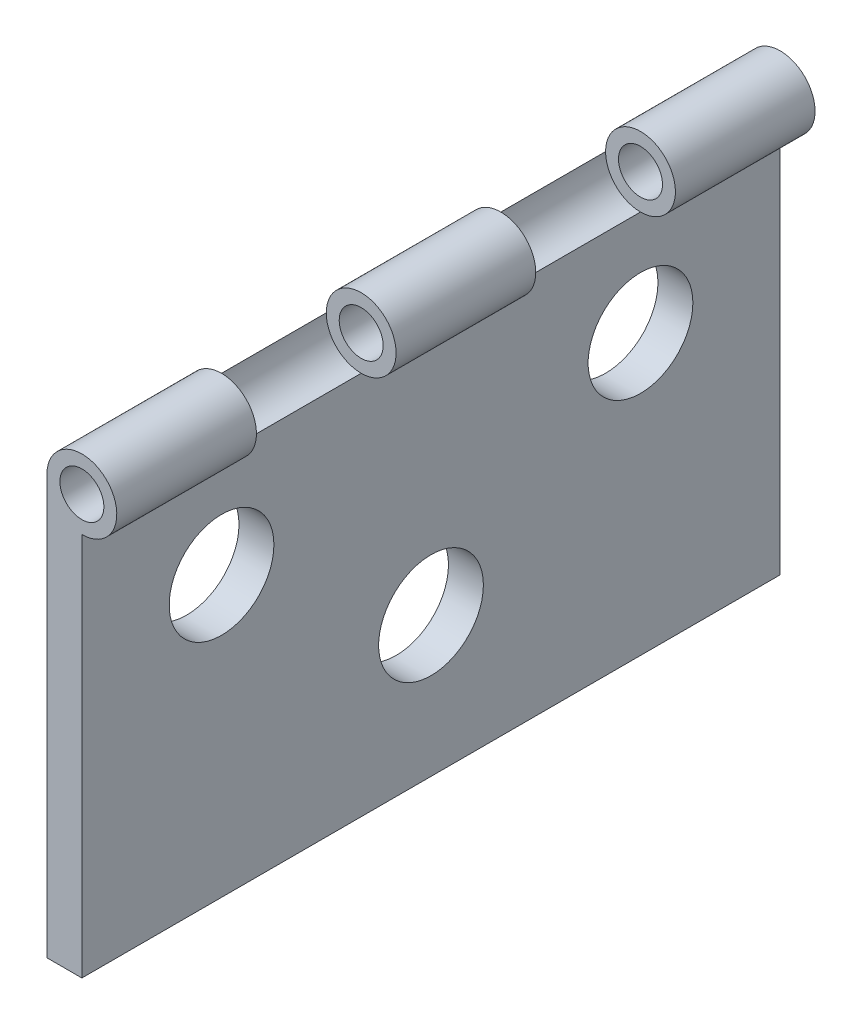
ISO-10303-21;
HEADER;
FILE_DESCRIPTION(('STEP AP214'),'2;1');
FILE_NAME('part.step','',(''),(''),'','','');
FILE_SCHEMA(('AUTOMOTIVE_DESIGN { 1 0 10303 214 1 1 1 1 }'));
ENDSEC;
DATA;
#1=APPLICATION_CONTEXT('core data for automotive mechanical design processes');
#2=APPLICATION_PROTOCOL_DEFINITION('international standard','automotive_design',2000,#1);
#3=PRODUCT_CONTEXT('',#1,'mechanical');
#4=PRODUCT('Part','Part','',(#3));
#5=PRODUCT_RELATED_PRODUCT_CATEGORY('part','',(#4));
#6=PRODUCT_DEFINITION_FORMATION('','',#4);
#7=PRODUCT_DEFINITION_CONTEXT('part definition',#1,'design');
#8=PRODUCT_DEFINITION('design','',#6,#7);
#9=PRODUCT_DEFINITION_SHAPE('','',#8);
#10=(LENGTH_UNIT() NAMED_UNIT(*) SI_UNIT(.MILLI.,.METRE.));
#11=(NAMED_UNIT(*) PLANE_ANGLE_UNIT() SI_UNIT($,.RADIAN.));
#12=(NAMED_UNIT(*) SI_UNIT($,.STERADIAN.) SOLID_ANGLE_UNIT());
#13=UNCERTAINTY_MEASURE_WITH_UNIT(LENGTH_MEASURE(1.E-05),#10,'distance_accuracy_value','');
#14=(GEOMETRIC_REPRESENTATION_CONTEXT(3) GLOBAL_UNCERTAINTY_ASSIGNED_CONTEXT((#13)) GLOBAL_UNIT_ASSIGNED_CONTEXT((#10,
#11,#12)) REPRESENTATION_CONTEXT('',''));
#15=CARTESIAN_POINT('',(0.,0.,0.));
#16=DIRECTION('',(0.,0.,1.));
#17=DIRECTION('',(1.,0.,0.));
#18=AXIS2_PLACEMENT_3D('',#15,#16,#17);
#19=CARTESIAN_POINT('',(1.25000000001163,15.0000000000015,0.));
#20=DIRECTION('',(0.,0.,-0.999999999999977));
#21=DIRECTION('',(0.,1.00000000000009,0.));
#22=AXIS2_PLACEMENT_3D('',#19,#20,#21);
#23=CYLINDRICAL_SURFACE('',#22,0.7875);
#24=CARTESIAN_POINT('',(1.25000000001163,15.0000000000016,0.));
#25=DIRECTION('',(0.,0.,-0.999999999999977));
#26=DIRECTION('',(0.,1.00000000000009,0.));
#27=AXIS2_PLACEMENT_3D('',#24,#25,#26);
#28=CIRCLE('',#27,0.7875);
#29=CARTESIAN_POINT('',(1.25000000001163,15.7875000000016,0.));
#30=VERTEX_POINT('',#29);
#31=EDGE_CURVE('E127',#30,#30,#28,.T.);
#32=ORIENTED_EDGE('',*,*,#31,.F.);
#33=EDGE_LOOP('',(#32));
#34=FACE_BOUND('',#33,.T.);
#35=CARTESIAN_POINT('',(1.25000000001163,15.0000000000018,-4.99999999999998));
#36=DIRECTION('',(0.,0.,-0.999999999999977));
#37=DIRECTION('',(0.,1.00000000000009,0.));
#38=AXIS2_PLACEMENT_3D('',#35,#36,#37);
#39=CIRCLE('',#38,0.7875);
#40=CARTESIAN_POINT('',(1.25000000001163,15.7875000000019,-4.99999999999998));
#41=VERTEX_POINT('',#40);
#42=EDGE_CURVE('E11',#41,#41,#39,.T.);
#43=ORIENTED_EDGE('',*,*,#42,.T.);
#44=EDGE_LOOP('',(#43));
#45=FACE_BOUND('',#44,.T.);
#46=ADVANCED_FACE('F32',(#34,#45),#23,.F.);
#47=CARTESIAN_POINT('',(1.25000000001163,15.0000000000007,-9.99999999999998));
#48=DIRECTION('',(0.,0.,-0.999999999999977));
#49=DIRECTION('',(0.,1.00000000000009,0.));
#50=AXIS2_PLACEMENT_3D('',#47,#48,#49);
#51=CIRCLE('',#50,0.7875);
#52=CARTESIAN_POINT('',(1.25000000001163,15.7875000000008,-9.99999999999998));
#53=VERTEX_POINT('',#52);
#54=EDGE_CURVE('E131',#53,#53,#51,.T.);
#55=ORIENTED_EDGE('',*,*,#54,.F.);
#56=EDGE_LOOP('',(#55));
#57=FACE_BOUND('',#56,.T.);
#58=CARTESIAN_POINT('',(1.25000000001163,15.000000000002,-15.));
#59=DIRECTION('',(0.,0.,-0.999999999999977));
#60=DIRECTION('',(0.,1.00000000000009,0.));
#61=AXIS2_PLACEMENT_3D('',#58,#59,#60);
#62=CIRCLE('',#61,0.7875);
#63=CARTESIAN_POINT('',(1.25000000001163,15.7875000000021,-15.));
#64=VERTEX_POINT('',#63);
#65=EDGE_CURVE('E228',#64,#64,#62,.T.);
#66=ORIENTED_EDGE('',*,*,#65,.T.);
#67=EDGE_LOOP('',(#66));
#68=FACE_BOUND('',#67,.T.);
#69=ADVANCED_FACE('F202',(#57,#68),#23,.F.);
#70=CARTESIAN_POINT('',(1.24999999999997,0.,0.));
#71=DIRECTION('',(-1.00000000000005,0.,0.));
#72=DIRECTION('',(0.,0.,0.999999999999977));
#73=AXIS2_PLACEMENT_3D('',#70,#71,#72);
#74=PLANE('',#73);
#75=CARTESIAN_POINT('',(1.25000000000008,9.99999999999854,-4.99999999999998));
#76=DIRECTION('',(1.00000000000005,0.,0.));
#77=DIRECTION('',(0.,0.,-0.999999999999977));
#78=AXIS2_PLACEMENT_3D('',#75,#76,#77);
#79=CIRCLE('',#78,1.875);
#80=CARTESIAN_POINT('',(1.25000000000008,9.99999999999853,-6.87499999999993));
#81=VERTEX_POINT('',#80);
#82=EDGE_CURVE('E153',#81,#81,#79,.T.);
#83=ORIENTED_EDGE('',*,*,#82,.F.);
#84=EDGE_LOOP('',(#83));
#85=FACE_BOUND('',#84,.T.);
#86=CARTESIAN_POINT('',(1.25000000000008,9.99999999999854,-19.9999999999992));
#87=DIRECTION('',(1.00000000000005,0.,0.));
#88=DIRECTION('',(0.,0.,-0.999999999999977));
#89=AXIS2_PLACEMENT_3D('',#86,#87,#88);
#90=CIRCLE('',#89,1.875);
#91=CARTESIAN_POINT('',(1.25000000000008,9.99999999999853,-21.8749999999992));
#92=VERTEX_POINT('',#91);
#93=EDGE_CURVE('E165',#92,#92,#90,.T.);
#94=ORIENTED_EDGE('',*,*,#93,.F.);
#95=EDGE_LOOP('',(#94));
#96=FACE_BOUND('',#95,.T.);
#97=CARTESIAN_POINT('',(1.25000000001163,4.99999999999862,-12.4999999999971));
#98=DIRECTION('',(1.00000000000005,0.,0.));
#99=DIRECTION('',(0.,0.,-0.999999999999977));
#100=AXIS2_PLACEMENT_3D('',#97,#98,#99);
#101=CIRCLE('',#100,1.875);
#102=CARTESIAN_POINT('',(1.25000000001163,4.99999999999861,-14.3749999999971));
#103=VERTEX_POINT('',#102);
#104=EDGE_CURVE('E159',#103,#103,#101,.T.);
#105=ORIENTED_EDGE('',*,*,#104,.F.);
#106=EDGE_LOOP('',(#105));
#107=FACE_BOUND('',#106,.T.);
#108=DIRECTION('',(0.,0.,-0.999999999999977));
#109=VECTOR('',#108,1.);
#110=CARTESIAN_POINT('',(1.24999999998843,13.7500000000007,-9.99999999999998));
#111=LINE('',#110,#109);
#112=CARTESIAN_POINT('',(1.24999999998843,13.7500000000014,-15.));
#113=VERTEX_POINT('',#112);
#114=CARTESIAN_POINT('',(1.24999999998843,13.7500000000007,-9.99999999999998));
#115=VERTEX_POINT('',#114);
#116=EDGE_CURVE('E112',#113,#115,#111,.F.);
#117=ORIENTED_EDGE('',*,*,#116,.T.);
#118=DIRECTION('',(0.,0.,-0.999999999999977));
#119=VECTOR('',#118,1.);
#120=CARTESIAN_POINT('',(1.24999999998843,13.7500000000013,-4.99999999999998));
#121=LINE('',#120,#119);
#122=CARTESIAN_POINT('',(1.24999999998843,13.7500000000013,-4.99999999999998));
#123=VERTEX_POINT('',#122);
#124=EDGE_CURVE('E99',#115,#123,#121,.F.);
#125=ORIENTED_EDGE('',*,*,#124,.T.);
#126=DIRECTION('',(0.,0.,-0.999999999999977));
#127=VECTOR('',#126,1.);
#128=CARTESIAN_POINT('',(1.24999999998843,13.7500000000007,0.));
#129=LINE('',#128,#127);
#130=CARTESIAN_POINT('',(1.24999999998843,13.7500000000007,0.));
#131=VERTEX_POINT('',#130);
#132=EDGE_CURVE('E47',#123,#131,#129,.F.);
#133=ORIENTED_EDGE('',*,*,#132,.T.);
#134=DIRECTION('',(0.,-1.00000000000009,0.));
#135=VECTOR('',#134,1.);
#136=CARTESIAN_POINT('',(1.24999999999997,0.,0.));
#137=LINE('',#136,#135);
#138=CARTESIAN_POINT('',(1.24999999999997,0.,0.));
#139=VERTEX_POINT('',#138);
#140=EDGE_CURVE('E171',#131,#139,#137,.T.);
#141=ORIENTED_EDGE('',*,*,#140,.T.);
#142=DIRECTION('',(0.,0.,-0.999999999999977));
#143=VECTOR('',#142,1.);
#144=CARTESIAN_POINT('',(1.24999999999997,0.,0.));
#145=LINE('',#144,#143);
#146=CARTESIAN_POINT('',(1.24999999999997,0.,-24.9999999999985));
#147=VERTEX_POINT('',#146);
#148=EDGE_CURVE('E173',#139,#147,#145,.T.);
#149=ORIENTED_EDGE('',*,*,#148,.T.);
#150=DIRECTION('',(0.,1.00000000000009,0.));
#151=VECTOR('',#150,1.);
#152=CARTESIAN_POINT('',(1.24999999999997,0.,-24.9999999999985));
#153=LINE('',#152,#151);
#154=CARTESIAN_POINT('',(1.24999999998843,13.7500000000012,-24.9999999999985));
#155=VERTEX_POINT('',#154);
#156=EDGE_CURVE('E54',#147,#155,#153,.T.);
#157=ORIENTED_EDGE('',*,*,#156,.T.);
#158=DIRECTION('',(0.,0.,-0.999999999999977));
#159=VECTOR('',#158,1.);
#160=CARTESIAN_POINT('',(1.24999999998843,13.7500000000005,-19.9999999999985));
#161=LINE('',#160,#159);
#162=CARTESIAN_POINT('',(1.24999999998843,13.7500000000005,-19.9999999999985));
#163=VERTEX_POINT('',#162);
#164=EDGE_CURVE('E148',#155,#163,#161,.F.);
#165=ORIENTED_EDGE('',*,*,#164,.T.);
#166=DIRECTION('',(0.,0.,-0.999999999999977));
#167=VECTOR('',#166,1.);
#168=CARTESIAN_POINT('',(1.24999999998843,13.7499999999999,-11.4644660940673));
#169=LINE('',#168,#167);
#170=EDGE_CURVE('E230',#163,#113,#169,.F.);
#171=ORIENTED_EDGE('',*,*,#170,.T.);
#172=EDGE_LOOP('',(#117,#125,#133,#141,#149,#157,#165,#171));
#173=FACE_BOUND('',#172,.T.);
#174=ADVANCED_FACE('F109',(#85,#96,#107,#173),#74,.F.);
#175=CARTESIAN_POINT('',(0.,0.,0.));
#176=DIRECTION('',(-1.00000000000005,0.,0.));
#177=DIRECTION('',(0.,0.,0.999999999999977));
#178=AXIS2_PLACEMENT_3D('',#175,#176,#177);
#179=PLANE('',#178);
#180=CARTESIAN_POINT('',(0.,4.99999999999852,-12.4999999999971));
#181=DIRECTION('',(1.00000000000005,0.,0.));
#182=DIRECTION('',(0.,0.,-0.999999999999977));
#183=AXIS2_PLACEMENT_3D('',#180,#181,#182);
#184=CIRCLE('',#183,1.875);
#185=CARTESIAN_POINT('',(0.,4.99999999999851,-14.3749999999971));
#186=VERTEX_POINT('',#185);
#187=EDGE_CURVE('E156',#186,#186,#184,.T.);
#188=ORIENTED_EDGE('',*,*,#187,.T.);
#189=EDGE_LOOP('',(#188));
#190=FACE_BOUND('',#189,.T.);
#191=DIRECTION('',(0.,-1.00000000000009,0.));
#192=VECTOR('',#191,1.);
#193=CARTESIAN_POINT('',(0.,0.,0.));
#194=LINE('',#193,#192);
#195=CARTESIAN_POINT('',(0.,15.,0.));
#196=VERTEX_POINT('',#195);
#197=CARTESIAN_POINT('',(0.,0.,0.));
#198=VERTEX_POINT('',#197);
#199=EDGE_CURVE('E168',#196,#198,#194,.T.);
#200=ORIENTED_EDGE('',*,*,#199,.F.);
#201=DIRECTION('',(0.,0.,-0.999999999999977));
#202=VECTOR('',#201,1.);
#203=CARTESIAN_POINT('',(0.,15.,0.));
#204=LINE('',#203,#202);
#205=CARTESIAN_POINT('',(0.,14.9999999999985,-4.99999999999998));
#206=VERTEX_POINT('',#205);
#207=EDGE_CURVE('E124',#196,#206,#204,.T.);
#208=ORIENTED_EDGE('',*,*,#207,.T.);
#209=DIRECTION('',(0.,0.,0.999999999999977));
#210=VECTOR('',#209,1.);
#211=CARTESIAN_POINT('',(0.,15.,0.));
#212=LINE('',#211,#210);
#213=CARTESIAN_POINT('',(0.,14.9999999999985,-9.99999999999998));
#214=VERTEX_POINT('',#213);
#215=EDGE_CURVE('E102',#214,#206,#212,.T.);
#216=ORIENTED_EDGE('',*,*,#215,.F.);
#217=CARTESIAN_POINT('',(0.,14.9999999999985,-15.));
#218=VERTEX_POINT('',#217);
#219=EDGE_CURVE('E243',#218,#214,#212,.T.);
#220=ORIENTED_EDGE('',*,*,#219,.F.);
#221=CARTESIAN_POINT('',(0.,14.9999999999971,-19.9999999999993));
#222=VERTEX_POINT('',#221);
#223=EDGE_CURVE('E187',#222,#218,#212,.T.);
#224=ORIENTED_EDGE('',*,*,#223,.F.);
#225=CARTESIAN_POINT('',(0.,15.,-24.9999999999993));
#226=VERTEX_POINT('',#225);
#227=EDGE_CURVE('E174',#226,#222,#212,.T.);
#228=ORIENTED_EDGE('',*,*,#227,.F.);
#229=DIRECTION('',(0.,1.00000000000009,0.));
#230=VECTOR('',#229,1.);
#231=CARTESIAN_POINT('',(0.,0.,-24.9999999999985));
#232=LINE('',#231,#230);
#233=CARTESIAN_POINT('',(0.,0.,-24.9999999999985));
#234=VERTEX_POINT('',#233);
#235=EDGE_CURVE('E182',#234,#226,#232,.T.);
#236=ORIENTED_EDGE('',*,*,#235,.F.);
#237=DIRECTION('',(0.,0.,-0.999999999999977));
#238=VECTOR('',#237,1.);
#239=CARTESIAN_POINT('',(0.,0.,0.));
#240=LINE('',#239,#238);
#241=EDGE_CURVE('E180',#198,#234,#240,.T.);
#242=ORIENTED_EDGE('',*,*,#241,.F.);
#243=EDGE_LOOP('',(#200,#208,#216,#220,#224,#228,#236,#242));
#244=FACE_BOUND('',#243,.T.);
#245=CARTESIAN_POINT('',(-1.16573417585641E-11,9.99999999999834,-19.9999999999992));
#246=DIRECTION('',(1.00000000000005,0.,0.));
#247=DIRECTION('',(0.,0.,-0.999999999999977));
#248=AXIS2_PLACEMENT_3D('',#245,#246,#247);
#249=CIRCLE('',#248,1.875);
#250=CARTESIAN_POINT('',(-1.16569135597512E-11,9.99999999999834,-21.8749999999992));
#251=VERTEX_POINT('',#250);
#252=EDGE_CURVE('E162',#251,#251,#249,.T.);
#253=ORIENTED_EDGE('',*,*,#252,.T.);
#254=EDGE_LOOP('',(#253));
#255=FACE_BOUND('',#254,.T.);
#256=CARTESIAN_POINT('',(-1.16573417585641E-11,9.999999999999,-4.99999999999998));
#257=DIRECTION('',(1.00000000000005,0.,0.));
#258=DIRECTION('',(0.,0.,-0.999999999999977));
#259=AXIS2_PLACEMENT_3D('',#256,#257,#258);
#260=CIRCLE('',#259,1.875);
#261=CARTESIAN_POINT('',(-1.16569135597512E-11,9.99999999999899,-6.87499999999993));
#262=VERTEX_POINT('',#261);
#263=EDGE_CURVE('E152',#262,#262,#260,.T.);
#264=ORIENTED_EDGE('',*,*,#263,.T.);
#265=EDGE_LOOP('',(#264));
#266=FACE_BOUND('',#265,.T.);
#267=ADVANCED_FACE('F220',(#190,#244,#255,#266),#179,.T.);
#268=CARTESIAN_POINT('',(1.24999999999997,0.,0.));
#269=DIRECTION('',(0.,0.,-0.999999999999977));
#270=DIRECTION('',(0.,1.00000000000009,0.));
#271=AXIS2_PLACEMENT_3D('',#268,#269,#270);
#272=PLANE('',#271);
#273=ORIENTED_EDGE('',*,*,#31,.T.);
#274=EDGE_LOOP('',(#273));
#275=FACE_BOUND('',#274,.T.);
#276=CARTESIAN_POINT('',(1.25000000001163,15.0000000000016,0.));
#277=DIRECTION('',(0.,0.,-0.999999999999977));
#278=DIRECTION('',(0.,1.00000000000009,0.));
#279=AXIS2_PLACEMENT_3D('',#276,#277,#278);
#280=CIRCLE('',#279,1.25);
#281=EDGE_CURVE('E122',#196,#131,#280,.T.);
#282=ORIENTED_EDGE('',*,*,#281,.F.);
#283=ORIENTED_EDGE('',*,*,#199,.T.);
#284=DIRECTION('',(-1.00000000000005,0.,0.));
#285=VECTOR('',#284,1.);
#286=CARTESIAN_POINT('',(1.24999999999997,0.,0.));
#287=LINE('',#286,#285);
#288=EDGE_CURVE('E190',#139,#198,#287,.T.);
#289=ORIENTED_EDGE('',*,*,#288,.F.);
#290=ORIENTED_EDGE('',*,*,#140,.F.);
#291=EDGE_LOOP('',(#282,#283,#289,#290));
#292=FACE_BOUND('',#291,.T.);
#293=ADVANCED_FACE('F34',(#275,#292),#272,.F.);
#294=CARTESIAN_POINT('',(1.24999999999997,0.,0.));
#295=DIRECTION('',(0.,1.00000000000009,0.));
#296=DIRECTION('',(0.,0.,0.999999999999977));
#297=AXIS2_PLACEMENT_3D('',#294,#295,#296);
#298=PLANE('',#297);
#299=ORIENTED_EDGE('',*,*,#241,.T.);
#300=DIRECTION('',(-1.00000000000005,0.,0.));
#301=VECTOR('',#300,1.);
#302=CARTESIAN_POINT('',(1.24999999999997,0.,-24.9999999999985));
#303=LINE('',#302,#301);
#304=EDGE_CURVE('E177',#147,#234,#303,.T.);
#305=ORIENTED_EDGE('',*,*,#304,.F.);
#306=ORIENTED_EDGE('',*,*,#148,.F.);
#307=ORIENTED_EDGE('',*,*,#288,.T.);
#308=EDGE_LOOP('',(#299,#305,#306,#307));
#309=FACE_BOUND('',#308,.T.);
#310=ADVANCED_FACE('F252',(#309),#298,.F.);
#311=CARTESIAN_POINT('',(1.24999999999997,0.,-24.9999999999985));
#312=DIRECTION('',(0.,0.,0.999999999999977));
#313=DIRECTION('',(0.,-1.00000000000009,0.));
#314=AXIS2_PLACEMENT_3D('',#311,#312,#313);
#315=PLANE('',#314);
#316=CARTESIAN_POINT('',(1.25000000001163,15.0000000000023,-24.9999999999993));
#317=DIRECTION('',(0.,0.,-0.999999999999977));
#318=DIRECTION('',(0.,1.00000000000009,0.));
#319=AXIS2_PLACEMENT_3D('',#316,#317,#318);
#320=CIRCLE('',#319,0.7875);
#321=CARTESIAN_POINT('',(1.25000000001163,15.7875000000024,-24.9999999999993));
#322=VERTEX_POINT('',#321);
#323=EDGE_CURVE('E141',#322,#322,#320,.T.);
#324=ORIENTED_EDGE('',*,*,#323,.F.);
#325=EDGE_LOOP('',(#324));
#326=FACE_BOUND('',#325,.T.);
#327=CARTESIAN_POINT('',(1.25000000001163,15.0000000000023,-24.9999999999993));
#328=DIRECTION('',(0.,0.,-0.999999999999977));
#329=DIRECTION('',(0.,1.00000000000009,0.));
#330=AXIS2_PLACEMENT_3D('',#327,#328,#329);
#331=CIRCLE('',#330,1.25);
#332=EDGE_CURVE('E144',#226,#155,#331,.T.);
#333=ORIENTED_EDGE('',*,*,#332,.T.);
#334=ORIENTED_EDGE('',*,*,#156,.F.);
#335=ORIENTED_EDGE('',*,*,#304,.T.);
#336=ORIENTED_EDGE('',*,*,#235,.T.);
#337=EDGE_LOOP('',(#333,#334,#335,#336));
#338=FACE_BOUND('',#337,.T.);
#339=ADVANCED_FACE('F255',(#326,#338),#315,.F.);
#340=CARTESIAN_POINT('',(1.25000000000008,9.99999999999854,-19.9999999999992));
#341=DIRECTION('',(-1.00000000000005,0.,0.));
#342=DIRECTION('',(0.,0.,0.999999999999977));
#343=AXIS2_PLACEMENT_3D('',#340,#341,#342);
#344=CYLINDRICAL_SURFACE('',#343,1.875);
#345=ORIENTED_EDGE('',*,*,#93,.T.);
#346=EDGE_LOOP('',(#345));
#347=FACE_BOUND('',#346,.T.);
#348=ORIENTED_EDGE('',*,*,#252,.F.);
#349=EDGE_LOOP('',(#348));
#350=FACE_BOUND('',#349,.T.);
#351=ADVANCED_FACE('F338',(#347,#350),#344,.F.);
#352=CARTESIAN_POINT('',(1.25000000001163,4.99999999999862,-12.4999999999971));
#353=DIRECTION('',(-1.00000000000005,0.,0.));
#354=DIRECTION('',(0.,0.,0.999999999999977));
#355=AXIS2_PLACEMENT_3D('',#352,#353,#354);
#356=CYLINDRICAL_SURFACE('',#355,1.875);
#357=ORIENTED_EDGE('',*,*,#104,.T.);
#358=EDGE_LOOP('',(#357));
#359=FACE_BOUND('',#358,.T.);
#360=ORIENTED_EDGE('',*,*,#187,.F.);
#361=EDGE_LOOP('',(#360));
#362=FACE_BOUND('',#361,.T.);
#363=ADVANCED_FACE('F330',(#359,#362),#356,.F.);
#364=CARTESIAN_POINT('',(1.25000000000008,9.99999999999854,-4.99999999999998));
#365=DIRECTION('',(-1.00000000000005,0.,0.));
#366=DIRECTION('',(0.,0.,0.999999999999977));
#367=AXIS2_PLACEMENT_3D('',#364,#365,#366);
#368=CYLINDRICAL_SURFACE('',#367,1.875);
#369=ORIENTED_EDGE('',*,*,#82,.T.);
#370=EDGE_LOOP('',(#369));
#371=FACE_BOUND('',#370,.T.);
#372=ORIENTED_EDGE('',*,*,#263,.F.);
#373=EDGE_LOOP('',(#372));
#374=FACE_BOUND('',#373,.T.);
#375=ADVANCED_FACE('F322',(#371,#374),#368,.F.);
#376=CARTESIAN_POINT('',(1.25000000001163,15.0000000000009,-19.9999999999993));
#377=DIRECTION('',(0.,0.,-0.999999999999977));
#378=DIRECTION('',(0.,1.00000000000009,0.));
#379=AXIS2_PLACEMENT_3D('',#376,#377,#378);
#380=CYLINDRICAL_SURFACE('',#379,1.25);
#381=ORIENTED_EDGE('',*,*,#164,.F.);
#382=ORIENTED_EDGE('',*,*,#332,.F.);
#383=ORIENTED_EDGE('',*,*,#227,.T.);
#384=CARTESIAN_POINT('',(1.25000000001163,15.0000000000009,-19.9999999999993));
#385=DIRECTION('',(0.,0.,-0.999999999999977));
#386=DIRECTION('',(0.,1.00000000000009,0.));
#387=AXIS2_PLACEMENT_3D('',#384,#385,#386);
#388=CIRCLE('',#387,1.25);
#389=EDGE_CURVE('E145',#222,#163,#388,.T.);
#390=ORIENTED_EDGE('',*,*,#389,.T.);
#391=EDGE_LOOP('',(#381,#382,#383,#390));
#392=FACE_BOUND('',#391,.T.);
#393=ADVANCED_FACE('F210',(#392),#380,.T.);
#394=CARTESIAN_POINT('',(1.25000000001163,15.0000000000009,-19.9999999999993));
#395=DIRECTION('',(0.,0.,-0.999999999999977));
#396=DIRECTION('',(0.,1.00000000000009,0.));
#397=AXIS2_PLACEMENT_3D('',#394,#395,#396);
#398=PLANE('',#397);
#399=CARTESIAN_POINT('',(1.25000000001163,15.0000000000009,-19.9999999999993));
#400=DIRECTION('',(0.,0.,-0.999999999999977));
#401=DIRECTION('',(0.,1.00000000000009,0.));
#402=AXIS2_PLACEMENT_3D('',#399,#400,#401);
#403=CIRCLE('',#402,1.25);
#404=EDGE_CURVE('E113',#163,#222,#403,.T.);
#405=ORIENTED_EDGE('',*,*,#404,.F.);
#406=ORIENTED_EDGE('',*,*,#389,.F.);
#407=EDGE_LOOP('',(#405,#406));
#408=FACE_BOUND('',#407,.T.);
#409=CARTESIAN_POINT('',(1.25000000001163,15.0000000000009,-19.9999999999993));
#410=DIRECTION('',(0.,0.,-0.999999999999977));
#411=DIRECTION('',(0.,1.00000000000009,0.));
#412=AXIS2_PLACEMENT_3D('',#409,#410,#411);
#413=CIRCLE('',#412,0.7875);
#414=CARTESIAN_POINT('',(1.25000000001163,15.7875000000009,-19.9999999999993));
#415=VERTEX_POINT('',#414);
#416=EDGE_CURVE('E40',#415,#415,#413,.T.);
#417=ORIENTED_EDGE('',*,*,#416,.T.);
#418=EDGE_LOOP('',(#417));
#419=FACE_BOUND('',#418,.T.);
#420=ADVANCED_FACE('F195',(#408,#419),#398,.F.);
#421=ORIENTED_EDGE('',*,*,#323,.T.);
#422=EDGE_LOOP('',(#421));
#423=FACE_BOUND('',#422,.T.);
#424=ORIENTED_EDGE('',*,*,#416,.F.);
#425=EDGE_LOOP('',(#424));
#426=FACE_BOUND('',#425,.T.);
#427=ADVANCED_FACE('F197',(#423,#426),#23,.F.);
#428=CARTESIAN_POINT('',(1.25000000001163,15.0000000000007,-9.99999999999998));
#429=DIRECTION('',(0.,0.,-0.999999999999977));
#430=DIRECTION('',(0.,1.00000000000009,0.));
#431=AXIS2_PLACEMENT_3D('',#428,#429,#430);
#432=CYLINDRICAL_SURFACE('',#431,1.25);
#433=ORIENTED_EDGE('',*,*,#116,.F.);
#434=CARTESIAN_POINT('',(1.25000000001163,15.000000000002,-15.));
#435=DIRECTION('',(0.,0.,-0.999999999999977));
#436=DIRECTION('',(0.,1.00000000000009,0.));
#437=AXIS2_PLACEMENT_3D('',#434,#435,#436);
#438=CIRCLE('',#437,1.25);
#439=EDGE_CURVE('E123',#218,#113,#438,.T.);
#440=ORIENTED_EDGE('',*,*,#439,.F.);
#441=ORIENTED_EDGE('',*,*,#219,.T.);
#442=CARTESIAN_POINT('',(1.25000000001163,15.0000000000007,-9.99999999999998));
#443=DIRECTION('',(0.,0.,-0.999999999999977));
#444=DIRECTION('',(0.,1.00000000000009,0.));
#445=AXIS2_PLACEMENT_3D('',#442,#443,#444);
#446=CIRCLE('',#445,1.25);
#447=EDGE_CURVE('E135',#214,#115,#446,.T.);
#448=ORIENTED_EDGE('',*,*,#447,.T.);
#449=EDGE_LOOP('',(#433,#440,#441,#448));
#450=FACE_BOUND('',#449,.T.);
#451=ADVANCED_FACE('F199',(#450),#432,.T.);
#452=CARTESIAN_POINT('',(1.25000000001163,15.0000000000007,-9.99999999999998));
#453=DIRECTION('',(0.,0.,-0.999999999999977));
#454=DIRECTION('',(0.,1.00000000000009,0.));
#455=AXIS2_PLACEMENT_3D('',#452,#453,#454);
#456=PLANE('',#455);
#457=ORIENTED_EDGE('',*,*,#54,.T.);
#458=EDGE_LOOP('',(#457));
#459=FACE_BOUND('',#458,.T.);
#460=ORIENTED_EDGE('',*,*,#447,.F.);
#461=CARTESIAN_POINT('',(1.25000000001163,15.0000000000007,-9.99999999999998));
#462=DIRECTION('',(0.,0.,-0.999999999999977));
#463=DIRECTION('',(0.,1.00000000000009,0.));
#464=AXIS2_PLACEMENT_3D('',#461,#462,#463);
#465=CIRCLE('',#464,1.25);
#466=EDGE_CURVE('E106',#115,#214,#465,.T.);
#467=ORIENTED_EDGE('',*,*,#466,.F.);
#468=EDGE_LOOP('',(#460,#467));
#469=FACE_BOUND('',#468,.T.);
#470=ADVANCED_FACE('F207',(#459,#469),#456,.F.);
#471=CARTESIAN_POINT('',(1.25000000001163,15.000000000002,-15.));
#472=DIRECTION('',(0.,0.,-0.999999999999977));
#473=DIRECTION('',(0.,1.00000000000009,0.));
#474=AXIS2_PLACEMENT_3D('',#471,#472,#473);
#475=PLANE('',#474);
#476=ORIENTED_EDGE('',*,*,#439,.T.);
#477=CARTESIAN_POINT('',(1.25000000001163,15.000000000002,-15.));
#478=DIRECTION('',(0.,0.,-0.999999999999977));
#479=DIRECTION('',(0.,1.00000000000009,0.));
#480=AXIS2_PLACEMENT_3D('',#477,#478,#479);
#481=CIRCLE('',#480,1.25);
#482=EDGE_CURVE('E233',#218,#113,#481,.F.);
#483=ORIENTED_EDGE('',*,*,#482,.F.);
#484=EDGE_LOOP('',(#476,#483));
#485=FACE_BOUND('',#484,.T.);
#486=ORIENTED_EDGE('',*,*,#65,.F.);
#487=EDGE_LOOP('',(#486));
#488=FACE_BOUND('',#487,.T.);
#489=ADVANCED_FACE('F263',(#485,#488),#475,.T.);
#490=CARTESIAN_POINT('',(1.25000000001163,15.0000000000018,-4.99999999999998));
#491=DIRECTION('',(0.,0.,-0.999999999999977));
#492=DIRECTION('',(0.,1.00000000000009,0.));
#493=AXIS2_PLACEMENT_3D('',#490,#491,#492);
#494=PLANE('',#493);
#495=ORIENTED_EDGE('',*,*,#42,.F.);
#496=EDGE_LOOP('',(#495));
#497=FACE_BOUND('',#496,.T.);
#498=CARTESIAN_POINT('',(1.25000000001163,15.0000000000018,-4.99999999999998));
#499=DIRECTION('',(0.,0.,-0.999999999999977));
#500=DIRECTION('',(0.,1.00000000000009,0.));
#501=AXIS2_PLACEMENT_3D('',#498,#499,#500);
#502=CIRCLE('',#501,1.25);
#503=EDGE_CURVE('E97',#123,#206,#502,.T.);
#504=ORIENTED_EDGE('',*,*,#503,.T.);
#505=CARTESIAN_POINT('',(1.25000000001163,15.0000000000018,-4.99999999999998));
#506=DIRECTION('',(0.,0.,-0.999999999999977));
#507=DIRECTION('',(0.,1.00000000000009,0.));
#508=AXIS2_PLACEMENT_3D('',#505,#506,#507);
#509=CIRCLE('',#508,1.25);
#510=EDGE_CURVE('E120',#206,#123,#509,.T.);
#511=ORIENTED_EDGE('',*,*,#510,.T.);
#512=EDGE_LOOP('',(#504,#511));
#513=FACE_BOUND('',#512,.T.);
#514=ADVANCED_FACE('F126',(#497,#513),#494,.T.);
#515=CARTESIAN_POINT('',(1.25000000001163,15.0000000000016,0.));
#516=DIRECTION('',(0.,0.,-0.999999999999977));
#517=DIRECTION('',(0.,1.00000000000009,0.));
#518=AXIS2_PLACEMENT_3D('',#515,#516,#517);
#519=CYLINDRICAL_SURFACE('',#518,1.25);
#520=ORIENTED_EDGE('',*,*,#132,.F.);
#521=ORIENTED_EDGE('',*,*,#510,.F.);
#522=ORIENTED_EDGE('',*,*,#207,.F.);
#523=ORIENTED_EDGE('',*,*,#281,.T.);
#524=EDGE_LOOP('',(#520,#521,#522,#523));
#525=FACE_BOUND('',#524,.T.);
#526=ADVANCED_FACE('F118',(#525),#519,.T.);
#527=CARTESIAN_POINT('',(1.25000000001163,15.0000000000005,-11.4644660940673));
#528=DIRECTION('',(0.,0.,-0.999999999999977));
#529=DIRECTION('',(0.,1.00000000000009,0.));
#530=AXIS2_PLACEMENT_3D('',#527,#528,#529);
#531=CYLINDRICAL_SURFACE('',#530,1.25);
#532=ORIENTED_EDGE('',*,*,#404,.T.);
#533=ORIENTED_EDGE('',*,*,#223,.T.);
#534=ORIENTED_EDGE('',*,*,#482,.T.);
#535=ORIENTED_EDGE('',*,*,#170,.F.);
#536=EDGE_LOOP('',(#532,#533,#534,#535));
#537=FACE_BOUND('',#536,.T.);
#538=ADVANCED_FACE('F264',(#537),#531,.F.);
#539=CARTESIAN_POINT('',(1.25000000001163,15.0000000000018,-4.99999999999998));
#540=DIRECTION('',(0.,0.,-0.999999999999977));
#541=DIRECTION('',(0.,1.00000000000009,0.));
#542=AXIS2_PLACEMENT_3D('',#539,#540,#541);
#543=CYLINDRICAL_SURFACE('',#542,1.25);
#544=ORIENTED_EDGE('',*,*,#466,.T.);
#545=ORIENTED_EDGE('',*,*,#215,.T.);
#546=ORIENTED_EDGE('',*,*,#503,.F.);
#547=ORIENTED_EDGE('',*,*,#124,.F.);
#548=EDGE_LOOP('',(#544,#545,#546,#547));
#549=FACE_BOUND('',#548,.T.);
#550=ADVANCED_FACE('F98',(#549),#543,.F.);
#551=CLOSED_SHELL('',(#46,#69,#174,#267,#293,#310,#339,#351,#363,#375,#393,#420,#427,#451,#470,
#489,#514,#526,#538,#550));
#552=MANIFOLD_SOLID_BREP('B2',#551);
#553=ADVANCED_BREP_SHAPE_REPRESENTATION('',(#18,#552),#14);
#554=SHAPE_DEFINITION_REPRESENTATION(#9,#553);
ENDSEC;
END-ISO-10303-21;
